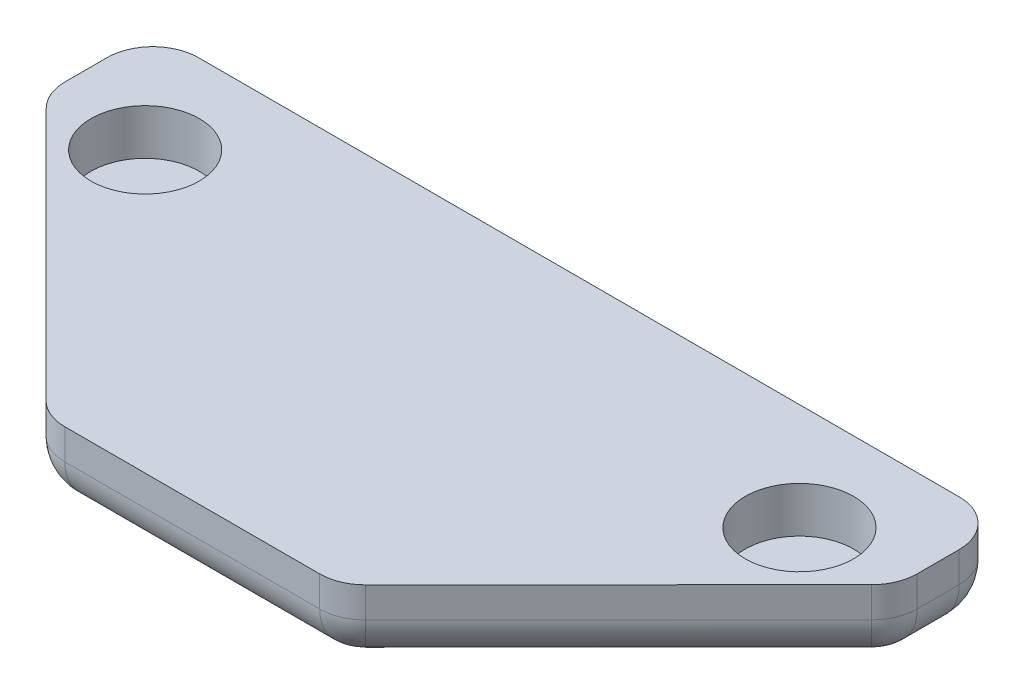
ISO-10303-21;
HEADER;
FILE_DESCRIPTION(('STEP AP214'),'2;1');
FILE_NAME('part.step','',(''),(''),'','','');
FILE_SCHEMA(('AUTOMOTIVE_DESIGN { 1 0 10303 214 1 1 1 1 }'));
ENDSEC;
DATA;
#1=APPLICATION_CONTEXT('core data for automotive mechanical design processes');
#2=APPLICATION_PROTOCOL_DEFINITION('international standard','automotive_design',2000,#1);
#3=PRODUCT_CONTEXT('',#1,'mechanical');
#4=PRODUCT('Part','Part','',(#3));
#5=PRODUCT_RELATED_PRODUCT_CATEGORY('part','',(#4));
#6=PRODUCT_DEFINITION_FORMATION('','',#4);
#7=PRODUCT_DEFINITION_CONTEXT('part definition',#1,'design');
#8=PRODUCT_DEFINITION('design','',#6,#7);
#9=PRODUCT_DEFINITION_SHAPE('','',#8);
#10=(LENGTH_UNIT() NAMED_UNIT(*) SI_UNIT(.MILLI.,.METRE.));
#11=(NAMED_UNIT(*) PLANE_ANGLE_UNIT() SI_UNIT($,.RADIAN.));
#12=(NAMED_UNIT(*) SI_UNIT($,.STERADIAN.) SOLID_ANGLE_UNIT());
#13=UNCERTAINTY_MEASURE_WITH_UNIT(LENGTH_MEASURE(1.E-05),#10,'distance_accuracy_value','');
#14=(GEOMETRIC_REPRESENTATION_CONTEXT(3) GLOBAL_UNCERTAINTY_ASSIGNED_CONTEXT((#13)) GLOBAL_UNIT_ASSIGNED_CONTEXT((#10,
#11,#12)) REPRESENTATION_CONTEXT('',''));
#15=CARTESIAN_POINT('',(0.,0.,0.));
#16=DIRECTION('',(0.,0.,1.));
#17=DIRECTION('',(1.,0.,0.));
#18=AXIS2_PLACEMENT_3D('',#15,#16,#17);
#19=CARTESIAN_POINT('',(-7.21615383625442,2.5,-11.7419034293701));
#20=DIRECTION('',(0.,0.,1.));
#21=DIRECTION('',(1.,0.,0.));
#22=AXIS2_PLACEMENT_3D('',#19,#20,#21);
#23=PLANE('',#22);
#24=DIRECTION('',(-1.,0.,0.));
#25=VECTOR('',#24,1.);
#26=CARTESIAN_POINT('',(-7.21615383625442,1.5,-11.7419034293701));
#27=LINE('',#26,#25);
#28=CARTESIAN_POINT('',(5.28384616374558,1.5,-11.7419034293701));
#29=VERTEX_POINT('',#28);
#30=CARTESIAN_POINT('',(-19.7161538362544,1.5,-11.7419034293701));
#31=VERTEX_POINT('',#30);
#32=EDGE_CURVE('E311',#29,#31,#27,.T.);
#33=ORIENTED_EDGE('',*,*,#32,.T.);
#34=DIRECTION('',(0.,-1.,0.));
#35=VECTOR('',#34,1.);
#36=CARTESIAN_POINT('',(-19.7161538362544,2.5,-11.7419034293701));
#37=LINE('',#36,#35);
#38=CARTESIAN_POINT('',(-19.7161538362544,2.5,-11.7419034293701));
#39=VERTEX_POINT('',#38);
#40=EDGE_CURVE('E314',#31,#39,#37,.F.);
#41=ORIENTED_EDGE('',*,*,#40,.T.);
#42=DIRECTION('',(-1.,0.,0.));
#43=VECTOR('',#42,1.);
#44=CARTESIAN_POINT('',(-7.21615383625442,2.5,-11.7419034293701));
#45=LINE('',#44,#43);
#46=CARTESIAN_POINT('',(5.28384616374558,2.5,-11.7419034293701));
#47=VERTEX_POINT('',#46);
#48=EDGE_CURVE('E266',#47,#39,#45,.T.);
#49=ORIENTED_EDGE('',*,*,#48,.F.);
#50=DIRECTION('',(0.,-1.,0.));
#51=VECTOR('',#50,1.);
#52=CARTESIAN_POINT('',(5.28384616374558,2.5,-11.7419034293701));
#53=LINE('',#52,#51);
#54=EDGE_CURVE('E215',#29,#47,#53,.F.);
#55=ORIENTED_EDGE('',*,*,#54,.F.);
#56=EDGE_LOOP('',(#33,#41,#49,#55));
#57=FACE_BOUND('',#56,.T.);
#58=ADVANCED_FACE('F45',(#57),#23,.F.);
#59=CARTESIAN_POINT('',(-21.2161538362544,2.5,-11.7419034293701));
#60=DIRECTION('',(1.,0.,0.));
#61=DIRECTION('',(0.,0.,-1.));
#62=AXIS2_PLACEMENT_3D('',#59,#60,#61);
#63=PLANE('',#62);
#64=DIRECTION('',(0.,0.,1.));
#65=VECTOR('',#64,1.);
#66=CARTESIAN_POINT('',(-21.2161538362544,1.5,-11.7419034293701));
#67=LINE('',#66,#65);
#68=CARTESIAN_POINT('',(-21.2161538362544,1.5,-10.2419034293701));
#69=VERTEX_POINT('',#68);
#70=CARTESIAN_POINT('',(-21.2161538362544,1.5,-8.86280756999537));
#71=VERTEX_POINT('',#70);
#72=EDGE_CURVE('E302',#69,#71,#67,.T.);
#73=ORIENTED_EDGE('',*,*,#72,.T.);
#74=DIRECTION('',(0.,-1.,0.));
#75=VECTOR('',#74,1.);
#76=CARTESIAN_POINT('',(-21.2161538362544,2.5,-8.86280756999537));
#77=LINE('',#76,#75);
#78=CARTESIAN_POINT('',(-21.2161538362544,2.5,-8.86280756999537));
#79=VERTEX_POINT('',#78);
#80=EDGE_CURVE('E308',#71,#79,#77,.F.);
#81=ORIENTED_EDGE('',*,*,#80,.T.);
#82=DIRECTION('',(0.,0.,1.));
#83=VECTOR('',#82,1.);
#84=CARTESIAN_POINT('',(-21.2161538362544,2.5,-11.7419034293701));
#85=LINE('',#84,#83);
#86=CARTESIAN_POINT('',(-21.2161538362544,2.5,-10.2419034293701));
#87=VERTEX_POINT('',#86);
#88=EDGE_CURVE('E274',#87,#79,#85,.T.);
#89=ORIENTED_EDGE('',*,*,#88,.F.);
#90=DIRECTION('',(0.,-1.,0.));
#91=VECTOR('',#90,1.);
#92=CARTESIAN_POINT('',(-21.2161538362544,2.5,-10.2419034293701));
#93=LINE('',#92,#91);
#94=EDGE_CURVE('E305',#87,#69,#93,.T.);
#95=ORIENTED_EDGE('',*,*,#94,.T.);
#96=EDGE_LOOP('',(#73,#81,#89,#95));
#97=FACE_BOUND('',#96,.T.);
#98=ADVANCED_FACE('F368',(#97),#63,.F.);
#99=CARTESIAN_POINT('',(-21.2161538362544,2.5,-8.24190342937014));
#100=DIRECTION('',(0.707441668944865,0.,-0.706771734749278));
#101=DIRECTION('',(-0.706771734749278,0.,-0.707441668944865));
#102=AXIS2_PLACEMENT_3D('',#99,#100,#101);
#103=PLANE('',#102);
#104=DIRECTION('',(0.706771734749278,0.,0.707441668944865));
#105=VECTOR('',#104,1.);
#106=CARTESIAN_POINT('',(-21.2161538362544,1.5,-8.24190342937014));
#107=LINE('',#106,#105);
#108=CARTESIAN_POINT('',(-20.7773163396717,1.5,-7.80264996787145));
#109=VERTEX_POINT('',#108);
#110=CARTESIAN_POINT('',(-12.4642919415987,1.5,0.518254172753775));
#111=VERTEX_POINT('',#110);
#112=EDGE_CURVE('E285',#109,#111,#107,.T.);
#113=ORIENTED_EDGE('',*,*,#112,.T.);
#114=DIRECTION('',(0.,-1.,0.));
#115=VECTOR('',#114,1.);
#116=CARTESIAN_POINT('',(-12.4642919415987,2.5,0.518254172753774));
#117=LINE('',#116,#115);
#118=CARTESIAN_POINT('',(-12.4642919415987,2.5,0.518254172753774));
#119=VERTEX_POINT('',#118);
#120=EDGE_CURVE('E291',#111,#119,#117,.F.);
#121=ORIENTED_EDGE('',*,*,#120,.T.);
#122=DIRECTION('',(0.706771734749278,0.,0.707441668944865));
#123=VECTOR('',#122,1.);
#124=CARTESIAN_POINT('',(-21.2161538362544,2.5,-8.24190342937014));
#125=LINE('',#124,#123);
#126=CARTESIAN_POINT('',(-20.7773163396717,2.5,-7.80264996787145));
#127=VERTEX_POINT('',#126);
#128=EDGE_CURVE('E165',#127,#119,#125,.T.);
#129=ORIENTED_EDGE('',*,*,#128,.F.);
#130=DIRECTION('',(0.,-1.,0.));
#131=VECTOR('',#130,1.);
#132=CARTESIAN_POINT('',(-20.7773163396717,2.5,-7.80264996787145));
#133=LINE('',#132,#131);
#134=EDGE_CURVE('E288',#127,#109,#133,.T.);
#135=ORIENTED_EDGE('',*,*,#134,.T.);
#136=EDGE_LOOP('',(#113,#121,#129,#135));
#137=FACE_BOUND('',#136,.T.);
#138=ADVANCED_FACE('F379',(#137),#103,.F.);
#139=CARTESIAN_POINT('',(-12.0248660663505,2.5,0.958096570629856));
#140=DIRECTION('',(0.,0.,-1.));
#141=DIRECTION('',(-1.,0.,0.));
#142=AXIS2_PLACEMENT_3D('',#139,#140,#141);
#143=PLANE('',#142);
#144=DIRECTION('',(1.,0.,0.));
#145=VECTOR('',#144,1.);
#146=CARTESIAN_POINT('',(-12.0248660663505,2.5,0.958096570629856));
#147=LINE('',#146,#145);
#148=CARTESIAN_POINT('',(-11.4031294381814,2.5,0.958096570629856));
#149=VERTEX_POINT('',#148);
#150=CARTESIAN_POINT('',(-3.02917823432742,2.5,0.958096570629856));
#151=VERTEX_POINT('',#150);
#152=EDGE_CURVE('E149',#149,#151,#147,.T.);
#153=ORIENTED_EDGE('',*,*,#152,.F.);
#154=DIRECTION('',(0.,-1.,0.));
#155=VECTOR('',#154,1.);
#156=CARTESIAN_POINT('',(-11.4031294381814,2.5,0.958096570629856));
#157=LINE('',#156,#155);
#158=CARTESIAN_POINT('',(-11.4031294381814,1.5,0.958096570629856));
#159=VERTEX_POINT('',#158);
#160=EDGE_CURVE('E282',#149,#159,#157,.T.);
#161=ORIENTED_EDGE('',*,*,#160,.T.);
#162=DIRECTION('',(1.,0.,0.));
#163=VECTOR('',#162,1.);
#164=CARTESIAN_POINT('',(-12.0248660663505,1.5,0.958096570629856));
#165=LINE('',#164,#163);
#166=CARTESIAN_POINT('',(-3.02917823432742,1.5,0.958096570629856));
#167=VERTEX_POINT('',#166);
#168=EDGE_CURVE('E164',#159,#167,#165,.T.);
#169=ORIENTED_EDGE('',*,*,#168,.T.);
#170=DIRECTION('',(0.,-1.,0.));
#171=VECTOR('',#170,1.);
#172=CARTESIAN_POINT('',(-3.02917823432742,2.5,0.958096570629856));
#173=LINE('',#172,#171);
#174=EDGE_CURVE('E170',#151,#167,#173,.T.);
#175=ORIENTED_EDGE('',*,*,#174,.F.);
#176=EDGE_LOOP('',(#153,#161,#169,#175));
#177=FACE_BOUND('',#176,.T.);
#178=ADVANCED_FACE('F178',(#177),#143,.F.);
#179=CARTESIAN_POINT('',(0.,2.5,0.));
#180=DIRECTION('',(0.,1.,0.));
#181=DIRECTION('',(0.,0.,1.));
#182=AXIS2_PLACEMENT_3D('',#179,#180,#181);
#183=PLANE('',#182);
#184=CARTESIAN_POINT('',(-17.9661538362544,2.5,-8.24190342937015));
#185=DIRECTION('',(0.,1.,0.));
#186=DIRECTION('',(0.,0.,1.));
#187=AXIS2_PLACEMENT_3D('',#184,#185,#186);
#188=CIRCLE('',#187,1.78);
#189=CARTESIAN_POINT('',(-17.9661538362544,2.5,-6.46190342937015));
#190=VERTEX_POINT('',#189);
#191=EDGE_CURVE('E267',#190,#190,#188,.T.);
#192=ORIENTED_EDGE('',*,*,#191,.F.);
#193=EDGE_LOOP('',(#192));
#194=FACE_BOUND('',#193,.T.);
#195=ORIENTED_EDGE('',*,*,#128,.T.);
#196=CARTESIAN_POINT('',(-11.4031294381814,2.5,-0.541903429370144));
#197=DIRECTION('',(0.,1.,0.));
#198=DIRECTION('',(0.,0.,1.));
#199=AXIS2_PLACEMENT_3D('',#196,#197,#198);
#200=CIRCLE('',#199,1.5);
#201=EDGE_CURVE('E158',#119,#149,#200,.T.);
#202=ORIENTED_EDGE('',*,*,#201,.T.);
#203=ORIENTED_EDGE('',*,*,#152,.T.);
#204=CARTESIAN_POINT('',(-3.02917823432742,2.5,-0.541903429370144));
#205=DIRECTION('',(0.,-1.,0.));
#206=DIRECTION('',(0.,0.,1.));
#207=AXIS2_PLACEMENT_3D('',#204,#205,#206);
#208=CIRCLE('',#207,1.5);
#209=CARTESIAN_POINT('',(-1.96801573091012,2.5,0.518254172753774));
#210=VERTEX_POINT('',#209);
#211=EDGE_CURVE('E155',#210,#151,#208,.T.);
#212=ORIENTED_EDGE('',*,*,#211,.F.);
#213=DIRECTION('',(-0.706771734749278,0.,0.707441668944865));
#214=VECTOR('',#213,1.);
#215=CARTESIAN_POINT('',(6.78384616374558,2.5,-8.24190342937014));
#216=LINE('',#215,#214);
#217=CARTESIAN_POINT('',(6.34500866716288,2.5,-7.80264996787145));
#218=VERTEX_POINT('',#217);
#219=EDGE_CURVE('E183',#218,#210,#216,.T.);
#220=ORIENTED_EDGE('',*,*,#219,.F.);
#221=CARTESIAN_POINT('',(5.28384616374558,2.5,-8.86280756999537));
#222=DIRECTION('',(0.,-1.,0.));
#223=DIRECTION('',(0.,0.,1.));
#224=AXIS2_PLACEMENT_3D('',#221,#222,#223);
#225=CIRCLE('',#224,1.5);
#226=CARTESIAN_POINT('',(6.78384616374558,2.5,-8.86280756999537));
#227=VERTEX_POINT('',#226);
#228=EDGE_CURVE('E176',#227,#218,#225,.T.);
#229=ORIENTED_EDGE('',*,*,#228,.F.);
#230=DIRECTION('',(0.,0.,1.));
#231=VECTOR('',#230,1.);
#232=CARTESIAN_POINT('',(6.78384616374558,2.5,-11.7419034293701));
#233=LINE('',#232,#231);
#234=CARTESIAN_POINT('',(6.78384616374558,2.5,-10.2419034293701));
#235=VERTEX_POINT('',#234);
#236=EDGE_CURVE('E190',#235,#227,#233,.T.);
#237=ORIENTED_EDGE('',*,*,#236,.F.);
#238=CARTESIAN_POINT('',(5.28384616374558,2.5,-10.2419034293701));
#239=DIRECTION('',(0.,-1.,0.));
#240=DIRECTION('',(0.,0.,1.));
#241=AXIS2_PLACEMENT_3D('',#238,#239,#240);
#242=CIRCLE('',#241,1.5);
#243=EDGE_CURVE('E199',#47,#235,#242,.T.);
#244=ORIENTED_EDGE('',*,*,#243,.F.);
#245=ORIENTED_EDGE('',*,*,#48,.T.);
#246=CARTESIAN_POINT('',(-19.7161538362544,2.5,-10.2419034293701));
#247=DIRECTION('',(0.,1.,0.));
#248=DIRECTION('',(0.,0.,1.));
#249=AXIS2_PLACEMENT_3D('',#246,#247,#248);
#250=CIRCLE('',#249,1.5);
#251=EDGE_CURVE('E294',#39,#87,#250,.T.);
#252=ORIENTED_EDGE('',*,*,#251,.T.);
#253=ORIENTED_EDGE('',*,*,#88,.T.);
#254=CARTESIAN_POINT('',(-19.7161538362544,2.5,-8.86280756999537));
#255=DIRECTION('',(0.,1.,0.));
#256=DIRECTION('',(0.,0.,1.));
#257=AXIS2_PLACEMENT_3D('',#254,#255,#256);
#258=CIRCLE('',#257,1.5);
#259=EDGE_CURVE('E297',#79,#127,#258,.T.);
#260=ORIENTED_EDGE('',*,*,#259,.T.);
#261=EDGE_LOOP('',(#195,#202,#203,#212,#220,#229,#237,#244,#245,#252,#253,#260));
#262=FACE_BOUND('',#261,.T.);
#263=CARTESIAN_POINT('',(3.53384616374558,2.5,-8.24190342937015));
#264=DIRECTION('',(0.,-1.,0.));
#265=DIRECTION('',(0.,0.,1.));
#266=AXIS2_PLACEMENT_3D('',#263,#264,#265);
#267=CIRCLE('',#266,1.78);
#268=CARTESIAN_POINT('',(3.53384616374558,2.5,-6.46190342937015));
#269=VERTEX_POINT('',#268);
#270=EDGE_CURVE('E261',#269,#269,#267,.T.);
#271=ORIENTED_EDGE('',*,*,#270,.T.);
#272=EDGE_LOOP('',(#271));
#273=FACE_BOUND('',#272,.T.);
#274=ADVANCED_FACE('F152',(#194,#262,#273),#183,.T.);
#275=CARTESIAN_POINT('',(0.,0.,0.));
#276=DIRECTION('',(0.,1.,0.));
#277=DIRECTION('',(0.,0.,1.));
#278=AXIS2_PLACEMENT_3D('',#275,#276,#277);
#279=PLANE('',#278);
#280=DIRECTION('',(-1.,0.,0.));
#281=VECTOR('',#280,1.);
#282=CARTESIAN_POINT('',(0.,0.,-10.2419034293701));
#283=LINE('',#282,#281);
#284=CARTESIAN_POINT('',(-19.7161538362544,0.,-10.2419034293701));
#285=VERTEX_POINT('',#284);
#286=CARTESIAN_POINT('',(5.28384616374558,0.,-10.2419034293701));
#287=VERTEX_POINT('',#286);
#288=EDGE_CURVE('E317',#285,#287,#283,.F.);
#289=ORIENTED_EDGE('',*,*,#288,.T.);
#290=DIRECTION('',(0.,0.,1.));
#291=VECTOR('',#290,1.);
#292=CARTESIAN_POINT('',(5.28384616374558,0.,0.));
#293=LINE('',#292,#291);
#294=CARTESIAN_POINT('',(5.28384616374558,0.,-8.86280756999537));
#295=VERTEX_POINT('',#294);
#296=EDGE_CURVE('E219',#295,#287,#293,.F.);
#297=ORIENTED_EDGE('',*,*,#296,.F.);
#298=DIRECTION('',(-0.706771734749278,0.,0.707441668944865));
#299=VECTOR('',#298,1.);
#300=CARTESIAN_POINT('',(-8.99629271349693,0.,5.43086715323706));
#301=LINE('',#300,#299);
#302=CARTESIAN_POINT('',(-3.02917823432742,0.,-0.541903429370144));
#303=VERTEX_POINT('',#302);
#304=EDGE_CURVE('E223',#303,#295,#301,.F.);
#305=ORIENTED_EDGE('',*,*,#304,.F.);
#306=DIRECTION('',(1.,0.,0.));
#307=VECTOR('',#306,1.);
#308=CARTESIAN_POINT('',(0.,0.,-0.541903429370144));
#309=LINE('',#308,#307);
#310=CARTESIAN_POINT('',(-11.4031294381814,0.,-0.541903429370144));
#311=VERTEX_POINT('',#310);
#312=EDGE_CURVE('E11',#303,#311,#309,.F.);
#313=ORIENTED_EDGE('',*,*,#312,.T.);
#314=DIRECTION('',(0.706771734749278,0.,0.707441668944865));
#315=VECTOR('',#314,1.);
#316=CARTESIAN_POINT('',(-5.4360149590119,0.,5.43086715323706));
#317=LINE('',#316,#315);
#318=CARTESIAN_POINT('',(-19.7161538362544,0.,-8.86280756999537));
#319=VERTEX_POINT('',#318);
#320=EDGE_CURVE('E55',#311,#319,#317,.F.);
#321=ORIENTED_EDGE('',*,*,#320,.T.);
#322=DIRECTION('',(0.,0.,1.));
#323=VECTOR('',#322,1.);
#324=CARTESIAN_POINT('',(-19.7161538362544,0.,0.));
#325=LINE('',#324,#323);
#326=EDGE_CURVE('E320',#319,#285,#325,.F.);
#327=ORIENTED_EDGE('',*,*,#326,.T.);
#328=EDGE_LOOP('',(#289,#297,#305,#313,#321,#327));
#329=FACE_BOUND('',#328,.T.);
#330=ADVANCED_FACE('F396',(#329),#279,.F.);
#331=CARTESIAN_POINT('',(-17.9661538362544,1.,-8.24190342937015));
#332=DIRECTION('',(0.,1.,0.));
#333=DIRECTION('',(0.,0.,1.));
#334=AXIS2_PLACEMENT_3D('',#331,#332,#333);
#335=CYLINDRICAL_SURFACE('',#334,1.78);
#336=CARTESIAN_POINT('',(-17.9661538362544,1.,-8.24190342937015));
#337=DIRECTION('',(0.,1.,0.));
#338=DIRECTION('',(0.,0.,1.));
#339=AXIS2_PLACEMENT_3D('',#336,#337,#338);
#340=CIRCLE('',#339,1.78);
#341=CARTESIAN_POINT('',(-17.9661538362544,1.,-6.46190342937015));
#342=VERTEX_POINT('',#341);
#343=EDGE_CURVE('E262',#342,#342,#340,.T.);
#344=ORIENTED_EDGE('',*,*,#343,.F.);
#345=EDGE_LOOP('',(#344));
#346=FACE_BOUND('',#345,.T.);
#347=ORIENTED_EDGE('',*,*,#191,.T.);
#348=EDGE_LOOP('',(#347));
#349=FACE_BOUND('',#348,.T.);
#350=ADVANCED_FACE('F503',(#346,#349),#335,.F.);
#351=CARTESIAN_POINT('',(-17.9661538362544,1.,-8.24190342937015));
#352=DIRECTION('',(0.,1.,0.));
#353=DIRECTION('',(0.,0.,1.));
#354=AXIS2_PLACEMENT_3D('',#351,#352,#353);
#355=PLANE('',#354);
#356=ORIENTED_EDGE('',*,*,#343,.T.);
#357=EDGE_LOOP('',(#356));
#358=FACE_BOUND('',#357,.T.);
#359=ADVANCED_FACE('F472',(#358),#355,.T.);
#360=CARTESIAN_POINT('',(-7.21615383625442,1.5,-10.2419034293701));
#361=DIRECTION('',(-1.,0.,0.));
#362=DIRECTION('',(0.,0.,1.));
#363=AXIS2_PLACEMENT_3D('',#360,#361,#362);
#364=CYLINDRICAL_SURFACE('',#363,1.5);
#365=ORIENTED_EDGE('',*,*,#32,.F.);
#366=CARTESIAN_POINT('',(5.28384616374558,1.5,-10.2419034293701));
#367=DIRECTION('',(-1.,0.,0.));
#368=DIRECTION('',(0.,0.,1.));
#369=AXIS2_PLACEMENT_3D('',#366,#367,#368);
#370=CIRCLE('',#369,1.5);
#371=EDGE_CURVE('E257',#29,#287,#370,.T.);
#372=ORIENTED_EDGE('',*,*,#371,.T.);
#373=ORIENTED_EDGE('',*,*,#288,.F.);
#374=CARTESIAN_POINT('',(-19.7161538362544,1.5,-10.2419034293701));
#375=DIRECTION('',(-1.,0.,0.));
#376=DIRECTION('',(0.,0.,1.));
#377=AXIS2_PLACEMENT_3D('',#374,#375,#376);
#378=CIRCLE('',#377,1.5);
#379=EDGE_CURVE('E49',#31,#285,#378,.T.);
#380=ORIENTED_EDGE('',*,*,#379,.F.);
#381=EDGE_LOOP('',(#365,#372,#373,#380));
#382=FACE_BOUND('',#381,.T.);
#383=ADVANCED_FACE('F47',(#382),#364,.T.);
#384=CARTESIAN_POINT('',(-19.7161538362544,2.5,-10.2419034293701));
#385=DIRECTION('',(0.,-1.,0.));
#386=DIRECTION('',(0.,0.,-1.));
#387=AXIS2_PLACEMENT_3D('',#384,#385,#386);
#388=CYLINDRICAL_SURFACE('',#387,1.5);
#389=ORIENTED_EDGE('',*,*,#251,.F.);
#390=ORIENTED_EDGE('',*,*,#40,.F.);
#391=CARTESIAN_POINT('',(-19.7161538362544,1.5,-10.2419034293701));
#392=DIRECTION('',(0.,-1.,0.));
#393=DIRECTION('',(0.,0.,-1.));
#394=AXIS2_PLACEMENT_3D('',#391,#392,#393);
#395=CIRCLE('',#394,1.5);
#396=EDGE_CURVE('E350',#69,#31,#395,.T.);
#397=ORIENTED_EDGE('',*,*,#396,.F.);
#398=ORIENTED_EDGE('',*,*,#94,.F.);
#399=EDGE_LOOP('',(#389,#390,#397,#398));
#400=FACE_BOUND('',#399,.T.);
#401=ADVANCED_FACE('F466',(#400),#388,.T.);
#402=CARTESIAN_POINT('',(-19.7161538362544,1.5,-10.2419034293701));
#403=DIRECTION('',(0.,0.,-1.));
#404=DIRECTION('',(-1.,0.,0.));
#405=AXIS2_PLACEMENT_3D('',#402,#403,#404);
#406=SPHERICAL_SURFACE('',#405,1.5);
#407=ORIENTED_EDGE('',*,*,#396,.T.);
#408=ORIENTED_EDGE('',*,*,#379,.T.);
#409=CARTESIAN_POINT('',(-19.7161538362544,1.5,-10.2419034293701));
#410=DIRECTION('',(0.,0.,-1.));
#411=DIRECTION('',(-1.,0.,0.));
#412=AXIS2_PLACEMENT_3D('',#409,#410,#411);
#413=CIRCLE('',#412,1.5);
#414=EDGE_CURVE('E347',#69,#285,#413,.F.);
#415=ORIENTED_EDGE('',*,*,#414,.F.);
#416=EDGE_LOOP('',(#407,#408,#415));
#417=FACE_BOUND('',#416,.T.);
#418=ADVANCED_FACE('F359',(#417),#406,.T.);
#419=CARTESIAN_POINT('',(-19.7161538362544,1.5,-11.7419034293701));
#420=DIRECTION('',(0.,0.,1.));
#421=DIRECTION('',(1.,0.,0.));
#422=AXIS2_PLACEMENT_3D('',#419,#420,#421);
#423=CYLINDRICAL_SURFACE('',#422,1.5);
#424=ORIENTED_EDGE('',*,*,#414,.T.);
#425=ORIENTED_EDGE('',*,*,#326,.F.);
#426=CARTESIAN_POINT('',(-19.7161538362544,1.5,-8.86280756999537));
#427=DIRECTION('',(0.,0.,1.));
#428=DIRECTION('',(1.,0.,0.));
#429=AXIS2_PLACEMENT_3D('',#426,#427,#428);
#430=CIRCLE('',#429,1.5);
#431=EDGE_CURVE('E343',#71,#319,#430,.T.);
#432=ORIENTED_EDGE('',*,*,#431,.F.);
#433=ORIENTED_EDGE('',*,*,#72,.F.);
#434=EDGE_LOOP('',(#424,#425,#432,#433));
#435=FACE_BOUND('',#434,.T.);
#436=ADVANCED_FACE('F364',(#435),#423,.T.);
#437=CARTESIAN_POINT('',(-19.7161538362544,2.5,-8.86280756999537));
#438=DIRECTION('',(0.,-1.,0.));
#439=DIRECTION('',(0.,0.,-1.));
#440=AXIS2_PLACEMENT_3D('',#437,#438,#439);
#441=CYLINDRICAL_SURFACE('',#440,1.5);
#442=ORIENTED_EDGE('',*,*,#259,.F.);
#443=ORIENTED_EDGE('',*,*,#80,.F.);
#444=CARTESIAN_POINT('',(-19.7161538362544,1.5,-8.86280756999537));
#445=DIRECTION('',(0.,-1.,0.));
#446=DIRECTION('',(0.,0.,-1.));
#447=AXIS2_PLACEMENT_3D('',#444,#445,#446);
#448=CIRCLE('',#447,1.5);
#449=EDGE_CURVE('E339',#109,#71,#448,.T.);
#450=ORIENTED_EDGE('',*,*,#449,.F.);
#451=ORIENTED_EDGE('',*,*,#134,.F.);
#452=EDGE_LOOP('',(#442,#443,#450,#451));
#453=FACE_BOUND('',#452,.T.);
#454=ADVANCED_FACE('F374',(#453),#441,.T.);
#455=CARTESIAN_POINT('',(-19.7161538362544,1.5,-8.86280756999537));
#456=DIRECTION('',(0.,-1.,0.));
#457=DIRECTION('',(0.,0.,-1.));
#458=AXIS2_PLACEMENT_3D('',#455,#456,#457);
#459=SPHERICAL_SURFACE('',#458,1.5);
#460=ORIENTED_EDGE('',*,*,#449,.T.);
#461=ORIENTED_EDGE('',*,*,#431,.T.);
#462=CARTESIAN_POINT('',(-19.7161538362544,1.5,-8.86280756999537));
#463=DIRECTION('',(-0.706771734749278,0.,-0.707441668944865));
#464=DIRECTION('',(-0.707441668944865,0.,0.706771734749278));
#465=AXIS2_PLACEMENT_3D('',#462,#463,#464);
#466=CIRCLE('',#465,1.5);
#467=EDGE_CURVE('E335',#109,#319,#466,.F.);
#468=ORIENTED_EDGE('',*,*,#467,.F.);
#469=EDGE_LOOP('',(#460,#461,#468));
#470=FACE_BOUND('',#469,.T.);
#471=ADVANCED_FACE('F457',(#470),#459,.T.);
#472=CARTESIAN_POINT('',(-12.0248660663505,1.5,-0.541903429370144));
#473=DIRECTION('',(1.,0.,0.));
#474=DIRECTION('',(0.,0.,-1.));
#475=AXIS2_PLACEMENT_3D('',#472,#473,#474);
#476=CYLINDRICAL_SURFACE('',#475,1.5);
#477=ORIENTED_EDGE('',*,*,#312,.F.);
#478=CARTESIAN_POINT('',(-3.02917823432742,1.5,-0.541903429370144));
#479=DIRECTION('',(-1.,0.,0.));
#480=DIRECTION('',(0.,0.,1.));
#481=AXIS2_PLACEMENT_3D('',#478,#479,#480);
#482=CIRCLE('',#481,1.5);
#483=EDGE_CURVE('E235',#303,#167,#482,.T.);
#484=ORIENTED_EDGE('',*,*,#483,.T.);
#485=ORIENTED_EDGE('',*,*,#168,.F.);
#486=CARTESIAN_POINT('',(-11.4031294381814,1.5,-0.541903429370144));
#487=DIRECTION('',(-1.,0.,0.));
#488=DIRECTION('',(0.,0.,1.));
#489=AXIS2_PLACEMENT_3D('',#486,#487,#488);
#490=CIRCLE('',#489,1.5);
#491=EDGE_CURVE('E331',#311,#159,#490,.T.);
#492=ORIENTED_EDGE('',*,*,#491,.F.);
#493=EDGE_LOOP('',(#477,#484,#485,#492));
#494=FACE_BOUND('',#493,.T.);
#495=ADVANCED_FACE('F390',(#494),#476,.T.);
#496=CARTESIAN_POINT('',(-20.1549913328371,1.5,-9.30206103149406));
#497=DIRECTION('',(0.706771734749278,0.,0.707441668944865));
#498=DIRECTION('',(0.707441668944865,0.,-0.706771734749278));
#499=AXIS2_PLACEMENT_3D('',#496,#497,#498);
#500=CYLINDRICAL_SURFACE('',#499,1.5);
#501=ORIENTED_EDGE('',*,*,#467,.T.);
#502=ORIENTED_EDGE('',*,*,#320,.F.);
#503=CARTESIAN_POINT('',(-11.4031294381814,1.5,-0.541903429370142));
#504=DIRECTION('',(0.706771734749279,0.,0.707441668944865));
#505=DIRECTION('',(0.707441668944865,0.,-0.706771734749279));
#506=AXIS2_PLACEMENT_3D('',#503,#504,#505);
#507=CIRCLE('',#506,1.5);
#508=EDGE_CURVE('E327',#111,#311,#507,.T.);
#509=ORIENTED_EDGE('',*,*,#508,.F.);
#510=ORIENTED_EDGE('',*,*,#112,.F.);
#511=EDGE_LOOP('',(#501,#502,#509,#510));
#512=FACE_BOUND('',#511,.T.);
#513=ADVANCED_FACE('F451',(#512),#500,.T.);
#514=CARTESIAN_POINT('',(-11.4031294381814,1.5,-0.541903429370144));
#515=DIRECTION('',(0.,-1.,0.));
#516=DIRECTION('',(1.,0.,0.));
#517=AXIS2_PLACEMENT_3D('',#514,#515,#516);
#518=SPHERICAL_SURFACE('',#517,1.5);
#519=ORIENTED_EDGE('',*,*,#508,.T.);
#520=ORIENTED_EDGE('',*,*,#491,.T.);
#521=CARTESIAN_POINT('',(-11.4031294381814,1.5,-0.541903429370144));
#522=DIRECTION('',(0.,-1.,0.));
#523=DIRECTION('',(0.,0.,-1.));
#524=AXIS2_PLACEMENT_3D('',#521,#522,#523);
#525=CIRCLE('',#524,1.5);
#526=EDGE_CURVE('E227',#111,#159,#525,.F.);
#527=ORIENTED_EDGE('',*,*,#526,.F.);
#528=EDGE_LOOP('',(#519,#520,#527));
#529=FACE_BOUND('',#528,.T.);
#530=ADVANCED_FACE('F387',(#529),#518,.T.);
#531=CARTESIAN_POINT('',(-11.4031294381814,2.5,-0.541903429370144));
#532=DIRECTION('',(0.,-1.,0.));
#533=DIRECTION('',(0.,0.,-1.));
#534=AXIS2_PLACEMENT_3D('',#531,#532,#533);
#535=CYLINDRICAL_SURFACE('',#534,1.5);
#536=ORIENTED_EDGE('',*,*,#201,.F.);
#537=ORIENTED_EDGE('',*,*,#120,.F.);
#538=ORIENTED_EDGE('',*,*,#526,.T.);
#539=ORIENTED_EDGE('',*,*,#160,.F.);
#540=EDGE_LOOP('',(#536,#537,#538,#539));
#541=FACE_BOUND('',#540,.T.);
#542=ADVANCED_FACE('F385',(#541),#535,.T.);
#543=CARTESIAN_POINT('',(6.78384616374558,2.5,-11.7419034293701));
#544=DIRECTION('',(-1.,0.,0.));
#545=DIRECTION('',(0.,0.,-1.));
#546=AXIS2_PLACEMENT_3D('',#543,#544,#545);
#547=PLANE('',#546);
#548=DIRECTION('',(0.,0.,1.));
#549=VECTOR('',#548,1.);
#550=CARTESIAN_POINT('',(6.78384616374558,1.5,-11.7419034293701));
#551=LINE('',#550,#549);
#552=CARTESIAN_POINT('',(6.78384616374558,1.5,-10.2419034293701));
#553=VERTEX_POINT('',#552);
#554=CARTESIAN_POINT('',(6.78384616374558,1.5,-8.86280756999537));
#555=VERTEX_POINT('',#554);
#556=EDGE_CURVE('E175',#553,#555,#551,.T.);
#557=ORIENTED_EDGE('',*,*,#556,.F.);
#558=DIRECTION('',(0.,-1.,0.));
#559=VECTOR('',#558,1.);
#560=CARTESIAN_POINT('',(6.78384616374558,2.5,-10.2419034293701));
#561=LINE('',#560,#559);
#562=EDGE_CURVE('E207',#235,#553,#561,.T.);
#563=ORIENTED_EDGE('',*,*,#562,.F.);
#564=ORIENTED_EDGE('',*,*,#236,.T.);
#565=DIRECTION('',(0.,-1.,0.));
#566=VECTOR('',#565,1.);
#567=CARTESIAN_POINT('',(6.78384616374558,2.5,-8.86280756999537));
#568=LINE('',#567,#566);
#569=EDGE_CURVE('E211',#555,#227,#568,.F.);
#570=ORIENTED_EDGE('',*,*,#569,.F.);
#571=EDGE_LOOP('',(#557,#563,#564,#570));
#572=FACE_BOUND('',#571,.T.);
#573=ADVANCED_FACE('F414',(#572),#547,.F.);
#574=CARTESIAN_POINT('',(6.78384616374558,2.5,-8.24190342937014));
#575=DIRECTION('',(-0.707441668944865,0.,-0.706771734749278));
#576=DIRECTION('',(0.706771734749278,0.,-0.707441668944865));
#577=AXIS2_PLACEMENT_3D('',#574,#575,#576);
#578=PLANE('',#577);
#579=DIRECTION('',(-0.706771734749278,0.,0.707441668944865));
#580=VECTOR('',#579,1.);
#581=CARTESIAN_POINT('',(6.78384616374558,1.5,-8.24190342937014));
#582=LINE('',#581,#580);
#583=CARTESIAN_POINT('',(6.34500866716288,1.5,-7.80264996787145));
#584=VERTEX_POINT('',#583);
#585=CARTESIAN_POINT('',(-1.96801573091012,1.5,0.518254172753775));
#586=VERTEX_POINT('',#585);
#587=EDGE_CURVE('E182',#584,#586,#582,.T.);
#588=ORIENTED_EDGE('',*,*,#587,.F.);
#589=DIRECTION('',(0.,-1.,0.));
#590=VECTOR('',#589,1.);
#591=CARTESIAN_POINT('',(6.34500866716288,2.5,-7.80264996787145));
#592=LINE('',#591,#590);
#593=EDGE_CURVE('E188',#218,#584,#592,.T.);
#594=ORIENTED_EDGE('',*,*,#593,.F.);
#595=ORIENTED_EDGE('',*,*,#219,.T.);
#596=DIRECTION('',(0.,-1.,0.));
#597=VECTOR('',#596,1.);
#598=CARTESIAN_POINT('',(-1.96801573091012,2.5,0.518254172753774));
#599=LINE('',#598,#597);
#600=EDGE_CURVE('E172',#586,#210,#599,.F.);
#601=ORIENTED_EDGE('',*,*,#600,.F.);
#602=EDGE_LOOP('',(#588,#594,#595,#601));
#603=FACE_BOUND('',#602,.T.);
#604=ADVANCED_FACE('F403',(#603),#578,.F.);
#605=CARTESIAN_POINT('',(3.53384616374558,1.,-8.24190342937015));
#606=DIRECTION('',(0.,1.,0.));
#607=DIRECTION('',(0.,0.,1.));
#608=AXIS2_PLACEMENT_3D('',#605,#606,#607);
#609=CYLINDRICAL_SURFACE('',#608,1.78);
#610=CARTESIAN_POINT('',(3.53384616374558,1.,-8.24190342937015));
#611=DIRECTION('',(0.,-1.,0.));
#612=DIRECTION('',(0.,0.,1.));
#613=AXIS2_PLACEMENT_3D('',#610,#611,#612);
#614=CIRCLE('',#613,1.78);
#615=CARTESIAN_POINT('',(3.53384616374558,1.,-6.46190342937015));
#616=VERTEX_POINT('',#615);
#617=EDGE_CURVE('E416',#616,#616,#614,.T.);
#618=ORIENTED_EDGE('',*,*,#617,.T.);
#619=EDGE_LOOP('',(#618));
#620=FACE_BOUND('',#619,.T.);
#621=ORIENTED_EDGE('',*,*,#270,.F.);
#622=EDGE_LOOP('',(#621));
#623=FACE_BOUND('',#622,.T.);
#624=ADVANCED_FACE('F425',(#620,#623),#609,.F.);
#625=CARTESIAN_POINT('',(3.53384616374558,1.,-8.24190342937015));
#626=DIRECTION('',(0.,1.,0.));
#627=DIRECTION('',(0.,0.,1.));
#628=AXIS2_PLACEMENT_3D('',#625,#626,#627);
#629=PLANE('',#628);
#630=ORIENTED_EDGE('',*,*,#617,.F.);
#631=EDGE_LOOP('',(#630));
#632=FACE_BOUND('',#631,.T.);
#633=ADVANCED_FACE('F427',(#632),#629,.T.);
#634=CARTESIAN_POINT('',(5.28384616374558,2.5,-10.2419034293701));
#635=DIRECTION('',(0.,-1.,0.));
#636=DIRECTION('',(0.,0.,-1.));
#637=AXIS2_PLACEMENT_3D('',#634,#635,#636);
#638=CYLINDRICAL_SURFACE('',#637,1.5);
#639=ORIENTED_EDGE('',*,*,#243,.T.);
#640=ORIENTED_EDGE('',*,*,#562,.T.);
#641=CARTESIAN_POINT('',(5.28384616374558,1.5,-10.2419034293701));
#642=DIRECTION('',(0.,1.,0.));
#643=DIRECTION('',(0.,0.,-1.));
#644=AXIS2_PLACEMENT_3D('',#641,#642,#643);
#645=CIRCLE('',#644,1.5);
#646=EDGE_CURVE('E253',#553,#29,#645,.T.);
#647=ORIENTED_EDGE('',*,*,#646,.T.);
#648=ORIENTED_EDGE('',*,*,#54,.T.);
#649=EDGE_LOOP('',(#639,#640,#647,#648));
#650=FACE_BOUND('',#649,.T.);
#651=ADVANCED_FACE('F434',(#650),#638,.T.);
#652=CARTESIAN_POINT('',(5.28384616374558,1.5,-10.2419034293701));
#653=DIRECTION('',(0.,0.,-1.));
#654=DIRECTION('',(1.,0.,0.));
#655=AXIS2_PLACEMENT_3D('',#652,#653,#654);
#656=SPHERICAL_SURFACE('',#655,1.5);
#657=ORIENTED_EDGE('',*,*,#646,.F.);
#658=CARTESIAN_POINT('',(5.28384616374558,1.5,-10.2419034293701));
#659=DIRECTION('',(0.,0.,1.));
#660=DIRECTION('',(1.,0.,0.));
#661=AXIS2_PLACEMENT_3D('',#658,#659,#660);
#662=CIRCLE('',#661,1.5);
#663=EDGE_CURVE('E249',#553,#287,#662,.F.);
#664=ORIENTED_EDGE('',*,*,#663,.T.);
#665=ORIENTED_EDGE('',*,*,#371,.F.);
#666=EDGE_LOOP('',(#657,#664,#665));
#667=FACE_BOUND('',#666,.T.);
#668=ADVANCED_FACE('F480',(#667),#656,.T.);
#669=CARTESIAN_POINT('',(5.28384616374558,1.5,-11.7419034293701));
#670=DIRECTION('',(0.,0.,1.));
#671=DIRECTION('',(-1.,0.,0.));
#672=AXIS2_PLACEMENT_3D('',#669,#670,#671);
#673=CYLINDRICAL_SURFACE('',#672,1.5);
#674=ORIENTED_EDGE('',*,*,#663,.F.);
#675=ORIENTED_EDGE('',*,*,#556,.T.);
#676=CARTESIAN_POINT('',(5.28384616374558,1.5,-8.86280756999537));
#677=DIRECTION('',(0.,0.,-1.));
#678=DIRECTION('',(-1.,0.,0.));
#679=AXIS2_PLACEMENT_3D('',#676,#677,#678);
#680=CIRCLE('',#679,1.5);
#681=EDGE_CURVE('E245',#555,#295,#680,.T.);
#682=ORIENTED_EDGE('',*,*,#681,.T.);
#683=ORIENTED_EDGE('',*,*,#296,.T.);
#684=EDGE_LOOP('',(#674,#675,#682,#683));
#685=FACE_BOUND('',#684,.T.);
#686=ADVANCED_FACE('F482',(#685),#673,.T.);
#687=CARTESIAN_POINT('',(5.28384616374558,2.5,-8.86280756999537));
#688=DIRECTION('',(0.,-1.,0.));
#689=DIRECTION('',(0.,0.,-1.));
#690=AXIS2_PLACEMENT_3D('',#687,#688,#689);
#691=CYLINDRICAL_SURFACE('',#690,1.5);
#692=ORIENTED_EDGE('',*,*,#228,.T.);
#693=ORIENTED_EDGE('',*,*,#593,.T.);
#694=CARTESIAN_POINT('',(5.28384616374558,1.5,-8.86280756999537));
#695=DIRECTION('',(0.,1.,0.));
#696=DIRECTION('',(0.,0.,-1.));
#697=AXIS2_PLACEMENT_3D('',#694,#695,#696);
#698=CIRCLE('',#697,1.5);
#699=EDGE_CURVE('E242',#584,#555,#698,.T.);
#700=ORIENTED_EDGE('',*,*,#699,.T.);
#701=ORIENTED_EDGE('',*,*,#569,.T.);
#702=EDGE_LOOP('',(#692,#693,#700,#701));
#703=FACE_BOUND('',#702,.T.);
#704=ADVANCED_FACE('F410',(#703),#691,.T.);
#705=CARTESIAN_POINT('',(5.28384616374558,1.5,-8.86280756999537));
#706=DIRECTION('',(0.,-1.,0.));
#707=DIRECTION('',(0.,0.,-1.));
#708=AXIS2_PLACEMENT_3D('',#705,#706,#707);
#709=SPHERICAL_SURFACE('',#708,1.5);
#710=ORIENTED_EDGE('',*,*,#699,.F.);
#711=CARTESIAN_POINT('',(5.28384616374558,1.5,-8.86280756999537));
#712=DIRECTION('',(-0.706771734749278,0.,0.707441668944865));
#713=DIRECTION('',(0.707441668944865,0.,0.706771734749278));
#714=AXIS2_PLACEMENT_3D('',#711,#712,#713);
#715=CIRCLE('',#714,1.5);
#716=EDGE_CURVE('E239',#584,#295,#715,.F.);
#717=ORIENTED_EDGE('',*,*,#716,.T.);
#718=ORIENTED_EDGE('',*,*,#681,.F.);
#719=EDGE_LOOP('',(#710,#717,#718));
#720=FACE_BOUND('',#719,.T.);
#721=ADVANCED_FACE('F484',(#720),#709,.T.);
#722=CARTESIAN_POINT('',(5.72268366032828,1.5,-9.30206103149406));
#723=DIRECTION('',(-0.706771734749278,0.,0.707441668944865));
#724=DIRECTION('',(-0.707441668944865,0.,-0.706771734749278));
#725=AXIS2_PLACEMENT_3D('',#722,#723,#724);
#726=CYLINDRICAL_SURFACE('',#725,1.5);
#727=ORIENTED_EDGE('',*,*,#716,.F.);
#728=ORIENTED_EDGE('',*,*,#587,.T.);
#729=CARTESIAN_POINT('',(-3.02917823432742,1.5,-0.541903429370142));
#730=DIRECTION('',(0.706771734749279,0.,-0.707441668944865));
#731=DIRECTION('',(-0.707441668944865,0.,-0.706771734749279));
#732=AXIS2_PLACEMENT_3D('',#729,#730,#731);
#733=CIRCLE('',#732,1.5);
#734=EDGE_CURVE('E231',#586,#303,#733,.T.);
#735=ORIENTED_EDGE('',*,*,#734,.T.);
#736=ORIENTED_EDGE('',*,*,#304,.T.);
#737=EDGE_LOOP('',(#727,#728,#735,#736));
#738=FACE_BOUND('',#737,.T.);
#739=ADVANCED_FACE('F398',(#738),#726,.T.);
#740=CARTESIAN_POINT('',(-3.02917823432742,1.5,-0.541903429370144));
#741=DIRECTION('',(0.,-1.,0.));
#742=DIRECTION('',(-1.,0.,0.));
#743=AXIS2_PLACEMENT_3D('',#740,#741,#742);
#744=SPHERICAL_SURFACE('',#743,1.5);
#745=ORIENTED_EDGE('',*,*,#734,.F.);
#746=CARTESIAN_POINT('',(-3.02917823432742,1.5,-0.541903429370144));
#747=DIRECTION('',(0.,1.,0.));
#748=DIRECTION('',(0.,0.,-1.));
#749=AXIS2_PLACEMENT_3D('',#746,#747,#748);
#750=CIRCLE('',#749,1.5);
#751=EDGE_CURVE('E228',#586,#167,#750,.F.);
#752=ORIENTED_EDGE('',*,*,#751,.T.);
#753=ORIENTED_EDGE('',*,*,#483,.F.);
#754=EDGE_LOOP('',(#745,#752,#753));
#755=FACE_BOUND('',#754,.T.);
#756=ADVANCED_FACE('F394',(#755),#744,.T.);
#757=CARTESIAN_POINT('',(-3.02917823432742,2.5,-0.541903429370144));
#758=DIRECTION('',(0.,-1.,0.));
#759=DIRECTION('',(0.,0.,-1.));
#760=AXIS2_PLACEMENT_3D('',#757,#758,#759);
#761=CYLINDRICAL_SURFACE('',#760,1.5);
#762=ORIENTED_EDGE('',*,*,#211,.T.);
#763=ORIENTED_EDGE('',*,*,#174,.T.);
#764=ORIENTED_EDGE('',*,*,#751,.F.);
#765=ORIENTED_EDGE('',*,*,#600,.T.);
#766=EDGE_LOOP('',(#762,#763,#764,#765));
#767=FACE_BOUND('',#766,.T.);
#768=ADVANCED_FACE('F169',(#767),#761,.T.);
#769=CLOSED_SHELL('',(#58,#98,#138,#178,#274,#330,#350,#359,#383,#401,#418,#436,#454,#471,#495,
#513,#530,#542,#573,#604,#624,#633,#651,#668,#686,#704,#721,#739,#756,#768));
#770=MANIFOLD_SOLID_BREP('B2',#769);
#771=ADVANCED_BREP_SHAPE_REPRESENTATION('',(#18,#770),#14);
#772=SHAPE_DEFINITION_REPRESENTATION(#9,#771);
ENDSEC;
END-ISO-10303-21;
